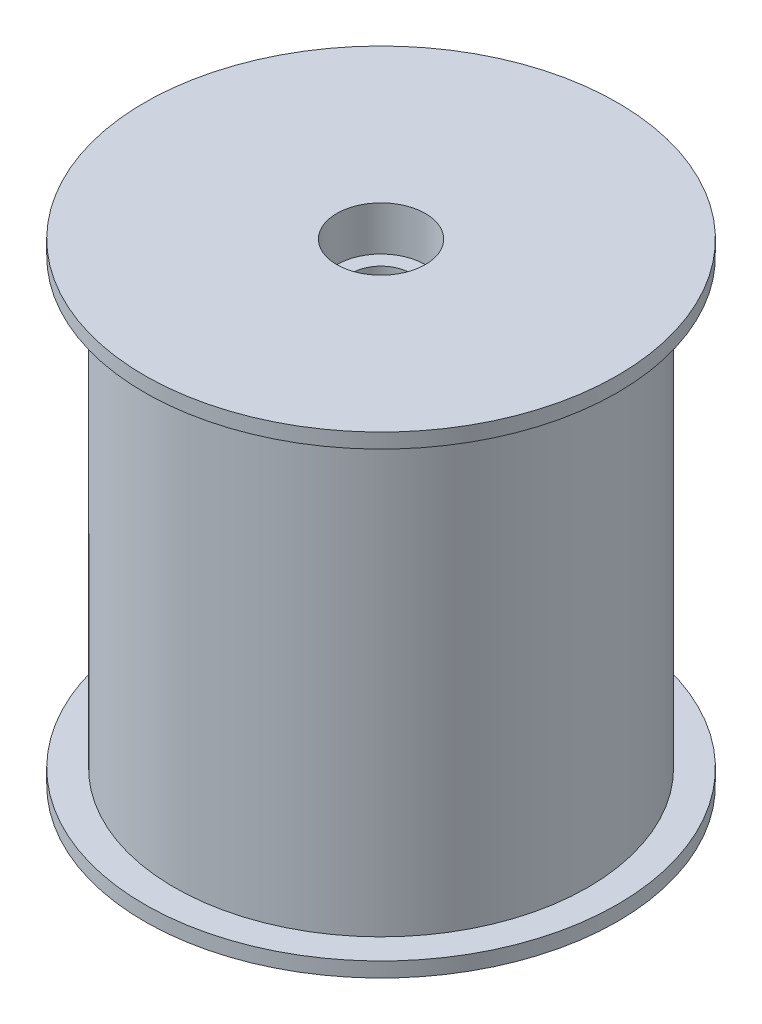
ISO-10303-21;
HEADER;
FILE_DESCRIPTION(('STEP AP214'),'2;1');
FILE_NAME('part.step','',(''),(''),'','','');
FILE_SCHEMA(('AUTOMOTIVE_DESIGN { 1 0 10303 214 1 1 1 1 }'));
ENDSEC;
DATA;
#1=APPLICATION_CONTEXT('core data for automotive mechanical design processes');
#2=APPLICATION_PROTOCOL_DEFINITION('international standard','automotive_design',2000,#1);
#3=PRODUCT_CONTEXT('',#1,'mechanical');
#4=PRODUCT('Part','Part','',(#3));
#5=PRODUCT_RELATED_PRODUCT_CATEGORY('part','',(#4));
#6=PRODUCT_DEFINITION_FORMATION('','',#4);
#7=PRODUCT_DEFINITION_CONTEXT('part definition',#1,'design');
#8=PRODUCT_DEFINITION('design','',#6,#7);
#9=PRODUCT_DEFINITION_SHAPE('','',#8);
#10=(LENGTH_UNIT() NAMED_UNIT(*) SI_UNIT(.MILLI.,.METRE.));
#11=(NAMED_UNIT(*) PLANE_ANGLE_UNIT() SI_UNIT($,.RADIAN.));
#12=(NAMED_UNIT(*) SI_UNIT($,.STERADIAN.) SOLID_ANGLE_UNIT());
#13=UNCERTAINTY_MEASURE_WITH_UNIT(LENGTH_MEASURE(1.E-05),#10,'distance_accuracy_value','');
#14=(GEOMETRIC_REPRESENTATION_CONTEXT(3) GLOBAL_UNCERTAINTY_ASSIGNED_CONTEXT((#13)) GLOBAL_UNIT_ASSIGNED_CONTEXT((#10,
#11,#12)) REPRESENTATION_CONTEXT('',''));
#15=CARTESIAN_POINT('',(0.,0.,0.));
#16=DIRECTION('',(0.,0.,1.));
#17=DIRECTION('',(1.,0.,0.));
#18=AXIS2_PLACEMENT_3D('',#15,#16,#17);
#19=CARTESIAN_POINT('',(0.,0.,0.));
#20=DIRECTION('',(0.,-1.,0.));
#21=DIRECTION('',(1.,0.,0.));
#22=AXIS2_PLACEMENT_3D('',#19,#20,#21);
#23=CYLINDRICAL_SURFACE('',#22,8.);
#24=CARTESIAN_POINT('',(0.,13.5078735821376,0.));
#25=DIRECTION('',(0.,-1.,0.));
#26=DIRECTION('',(1.,0.,0.));
#27=AXIS2_PLACEMENT_3D('',#24,#25,#26);
#28=CIRCLE('',#27,8.00000000000001);
#29=CARTESIAN_POINT('',(8.00000000000001,13.5078735821376,0.));
#30=VERTEX_POINT('',#29);
#31=EDGE_CURVE('E88',#30,#30,#28,.T.);
#32=ORIENTED_EDGE('',*,*,#31,.T.);
#33=EDGE_LOOP('',(#32));
#34=FACE_BOUND('',#33,.T.);
#35=CARTESIAN_POINT('',(0.,13.0078735821376,0.));
#36=DIRECTION('',(0.,-1.,0.));
#37=DIRECTION('',(1.,0.,0.));
#38=AXIS2_PLACEMENT_3D('',#35,#36,#37);
#39=CIRCLE('',#38,8.);
#40=CARTESIAN_POINT('',(8.,13.0078735821376,0.));
#41=VERTEX_POINT('',#40);
#42=EDGE_CURVE('E10',#41,#41,#39,.T.);
#43=ORIENTED_EDGE('',*,*,#42,.F.);
#44=EDGE_LOOP('',(#43));
#45=FACE_BOUND('',#44,.T.);
#46=ADVANCED_FACE('F37',(#34,#45),#23,.T.);
#47=CARTESIAN_POINT('',(8.,13.0078735821376,0.));
#48=DIRECTION('',(0.,-1.,0.));
#49=DIRECTION('',(1.,0.,0.));
#50=AXIS2_PLACEMENT_3D('',#47,#48,#49);
#51=PLANE('',#50);
#52=ORIENTED_EDGE('',*,*,#42,.T.);
#53=EDGE_LOOP('',(#52));
#54=FACE_BOUND('',#53,.T.);
#55=CARTESIAN_POINT('',(0.,13.0078735821376,0.));
#56=DIRECTION('',(0.,-1.,0.));
#57=DIRECTION('',(1.,0.,0.));
#58=AXIS2_PLACEMENT_3D('',#55,#56,#57);
#59=CIRCLE('',#58,7.);
#60=CARTESIAN_POINT('',(7.,13.0078735821376,0.));
#61=VERTEX_POINT('',#60);
#62=EDGE_CURVE('E44',#61,#61,#59,.T.);
#63=ORIENTED_EDGE('',*,*,#62,.F.);
#64=EDGE_LOOP('',(#63));
#65=FACE_BOUND('',#64,.T.);
#66=ADVANCED_FACE('F107',(#54,#65),#51,.T.);
#67=CARTESIAN_POINT('',(0.,0.,0.));
#68=DIRECTION('',(0.,-1.,0.));
#69=DIRECTION('',(1.,0.,0.));
#70=AXIS2_PLACEMENT_3D('',#67,#68,#69);
#71=CYLINDRICAL_SURFACE('',#70,7.);
#72=ORIENTED_EDGE('',*,*,#62,.T.);
#73=EDGE_LOOP('',(#72));
#74=FACE_BOUND('',#73,.T.);
#75=CARTESIAN_POINT('',(0.,-1.99212641786244,0.));
#76=DIRECTION('',(0.,-1.,0.));
#77=DIRECTION('',(1.,0.,0.));
#78=AXIS2_PLACEMENT_3D('',#75,#76,#77);
#79=CIRCLE('',#78,7.);
#80=CARTESIAN_POINT('',(7.,-1.99212641786244,0.));
#81=VERTEX_POINT('',#80);
#82=EDGE_CURVE('E49',#81,#81,#79,.T.);
#83=ORIENTED_EDGE('',*,*,#82,.F.);
#84=EDGE_LOOP('',(#83));
#85=FACE_BOUND('',#84,.T.);
#86=ADVANCED_FACE('F111',(#74,#85),#71,.T.);
#87=CARTESIAN_POINT('',(7.,-1.99212641786244,0.));
#88=DIRECTION('',(0.,1.,0.));
#89=DIRECTION('',(-1.,0.,0.));
#90=AXIS2_PLACEMENT_3D('',#87,#88,#89);
#91=PLANE('',#90);
#92=ORIENTED_EDGE('',*,*,#82,.T.);
#93=EDGE_LOOP('',(#92));
#94=FACE_BOUND('',#93,.T.);
#95=CARTESIAN_POINT('',(0.,-1.99212641786244,0.));
#96=DIRECTION('',(0.,-1.,0.));
#97=DIRECTION('',(1.,0.,0.));
#98=AXIS2_PLACEMENT_3D('',#95,#96,#97);
#99=CIRCLE('',#98,8.);
#100=CARTESIAN_POINT('',(8.,-1.99212641786244,0.));
#101=VERTEX_POINT('',#100);
#102=EDGE_CURVE('E54',#101,#101,#99,.T.);
#103=ORIENTED_EDGE('',*,*,#102,.F.);
#104=EDGE_LOOP('',(#103));
#105=FACE_BOUND('',#104,.T.);
#106=ADVANCED_FACE('F115',(#94,#105),#91,.T.);
#107=CARTESIAN_POINT('',(0.,0.,0.));
#108=DIRECTION('',(0.,-1.,0.));
#109=DIRECTION('',(1.,0.,0.));
#110=AXIS2_PLACEMENT_3D('',#107,#108,#109);
#111=CYLINDRICAL_SURFACE('',#110,8.);
#112=ORIENTED_EDGE('',*,*,#102,.T.);
#113=EDGE_LOOP('',(#112));
#114=FACE_BOUND('',#113,.T.);
#115=CARTESIAN_POINT('',(0.,-2.49212641786244,0.));
#116=DIRECTION('',(0.,-1.,0.));
#117=DIRECTION('',(1.,0.,0.));
#118=AXIS2_PLACEMENT_3D('',#115,#116,#117);
#119=CIRCLE('',#118,8.00000000000001);
#120=CARTESIAN_POINT('',(8.00000000000001,-2.49212641786244,0.));
#121=VERTEX_POINT('',#120);
#122=EDGE_CURVE('E60',#121,#121,#119,.T.);
#123=ORIENTED_EDGE('',*,*,#122,.F.);
#124=EDGE_LOOP('',(#123));
#125=FACE_BOUND('',#124,.T.);
#126=ADVANCED_FACE('F121',(#114,#125),#111,.T.);
#127=CARTESIAN_POINT('',(8.00000000000001,-2.49212641786244,0.));
#128=DIRECTION('',(0.,-1.,0.));
#129=DIRECTION('',(1.,0.,0.));
#130=AXIS2_PLACEMENT_3D('',#127,#128,#129);
#131=PLANE('',#130);
#132=ORIENTED_EDGE('',*,*,#122,.T.);
#133=EDGE_LOOP('',(#132));
#134=FACE_BOUND('',#133,.T.);
#135=CARTESIAN_POINT('',(0.,-2.49212641786244,0.));
#136=DIRECTION('',(0.,-1.,0.));
#137=DIRECTION('',(1.,0.,0.));
#138=AXIS2_PLACEMENT_3D('',#135,#136,#137);
#139=CIRCLE('',#138,3.75);
#140=CARTESIAN_POINT('',(3.75,-2.49212641786244,0.));
#141=VERTEX_POINT('',#140);
#142=EDGE_CURVE('E64',#141,#141,#139,.T.);
#143=ORIENTED_EDGE('',*,*,#142,.F.);
#144=EDGE_LOOP('',(#143));
#145=FACE_BOUND('',#144,.T.);
#146=ADVANCED_FACE('F125',(#134,#145),#131,.T.);
#147=CARTESIAN_POINT('',(0.,0.,0.));
#148=DIRECTION('',(0.,-1.,0.));
#149=DIRECTION('',(1.,0.,0.));
#150=AXIS2_PLACEMENT_3D('',#147,#148,#149);
#151=CYLINDRICAL_SURFACE('',#150,3.75);
#152=ORIENTED_EDGE('',*,*,#142,.T.);
#153=EDGE_LOOP('',(#152));
#154=FACE_BOUND('',#153,.T.);
#155=CARTESIAN_POINT('',(0.,10.5078735821376,0.));
#156=DIRECTION('',(0.,-1.,0.));
#157=DIRECTION('',(1.,0.,0.));
#158=AXIS2_PLACEMENT_3D('',#155,#156,#157);
#159=CIRCLE('',#158,3.75);
#160=CARTESIAN_POINT('',(3.75,10.5078735821376,0.));
#161=VERTEX_POINT('',#160);
#162=EDGE_CURVE('E68',#161,#161,#159,.T.);
#163=ORIENTED_EDGE('',*,*,#162,.F.);
#164=EDGE_LOOP('',(#163));
#165=FACE_BOUND('',#164,.T.);
#166=ADVANCED_FACE('F129',(#154,#165),#151,.F.);
#167=CARTESIAN_POINT('',(3.75,10.5078735821376,0.));
#168=DIRECTION('',(0.,-1.,0.));
#169=DIRECTION('',(1.,0.,0.));
#170=AXIS2_PLACEMENT_3D('',#167,#168,#169);
#171=PLANE('',#170);
#172=ORIENTED_EDGE('',*,*,#162,.T.);
#173=EDGE_LOOP('',(#172));
#174=FACE_BOUND('',#173,.T.);
#175=CARTESIAN_POINT('',(0.,10.5078735821376,0.));
#176=DIRECTION('',(0.,-1.,0.));
#177=DIRECTION('',(1.,0.,0.));
#178=AXIS2_PLACEMENT_3D('',#175,#176,#177);
#179=CIRCLE('',#178,1.);
#180=CARTESIAN_POINT('',(1.,10.5078735821376,0.));
#181=VERTEX_POINT('',#180);
#182=EDGE_CURVE('E72',#181,#181,#179,.T.);
#183=ORIENTED_EDGE('',*,*,#182,.F.);
#184=EDGE_LOOP('',(#183));
#185=FACE_BOUND('',#184,.T.);
#186=ADVANCED_FACE('F133',(#174,#185),#171,.T.);
#187=CARTESIAN_POINT('',(0.,0.,0.));
#188=DIRECTION('',(0.,-1.,0.));
#189=DIRECTION('',(1.,0.,0.));
#190=AXIS2_PLACEMENT_3D('',#187,#188,#189);
#191=CYLINDRICAL_SURFACE('',#190,1.);
#192=ORIENTED_EDGE('',*,*,#182,.T.);
#193=EDGE_LOOP('',(#192));
#194=FACE_BOUND('',#193,.T.);
#195=CARTESIAN_POINT('',(0.,12.0078735821376,0.));
#196=DIRECTION('',(0.,-1.,0.));
#197=DIRECTION('',(1.,0.,0.));
#198=AXIS2_PLACEMENT_3D('',#195,#196,#197);
#199=CIRCLE('',#198,1.);
#200=CARTESIAN_POINT('',(1.,12.0078735821376,0.));
#201=VERTEX_POINT('',#200);
#202=EDGE_CURVE('E76',#201,#201,#199,.T.);
#203=ORIENTED_EDGE('',*,*,#202,.F.);
#204=EDGE_LOOP('',(#203));
#205=FACE_BOUND('',#204,.T.);
#206=ADVANCED_FACE('F137',(#194,#205),#191,.F.);
#207=CARTESIAN_POINT('',(1.5,12.0078735821376,0.));
#208=DIRECTION('',(0.,1.,0.));
#209=DIRECTION('',(-1.,0.,0.));
#210=AXIS2_PLACEMENT_3D('',#207,#208,#209);
#211=PLANE('',#210);
#212=ORIENTED_EDGE('',*,*,#202,.T.);
#213=EDGE_LOOP('',(#212));
#214=FACE_BOUND('',#213,.T.);
#215=CARTESIAN_POINT('',(0.,12.0078735821376,0.));
#216=DIRECTION('',(0.,-1.,0.));
#217=DIRECTION('',(1.,0.,0.));
#218=AXIS2_PLACEMENT_3D('',#215,#216,#217);
#219=CIRCLE('',#218,1.5);
#220=CARTESIAN_POINT('',(1.5,12.0078735821376,0.));
#221=VERTEX_POINT('',#220);
#222=EDGE_CURVE('E80',#221,#221,#219,.T.);
#223=ORIENTED_EDGE('',*,*,#222,.F.);
#224=EDGE_LOOP('',(#223));
#225=FACE_BOUND('',#224,.T.);
#226=ADVANCED_FACE('F103',(#214,#225),#211,.T.);
#227=CARTESIAN_POINT('',(0.,0.,0.));
#228=DIRECTION('',(0.,-1.,0.));
#229=DIRECTION('',(1.,0.,0.));
#230=AXIS2_PLACEMENT_3D('',#227,#228,#229);
#231=CYLINDRICAL_SURFACE('',#230,1.5);
#232=ORIENTED_EDGE('',*,*,#222,.T.);
#233=EDGE_LOOP('',(#232));
#234=FACE_BOUND('',#233,.T.);
#235=CARTESIAN_POINT('',(0.,13.5078735821376,0.));
#236=DIRECTION('',(0.,-1.,0.));
#237=DIRECTION('',(1.,0.,0.));
#238=AXIS2_PLACEMENT_3D('',#235,#236,#237);
#239=CIRCLE('',#238,1.5);
#240=CARTESIAN_POINT('',(1.5,13.5078735821376,0.));
#241=VERTEX_POINT('',#240);
#242=EDGE_CURVE('E84',#241,#241,#239,.T.);
#243=ORIENTED_EDGE('',*,*,#242,.F.);
#244=EDGE_LOOP('',(#243));
#245=FACE_BOUND('',#244,.T.);
#246=ADVANCED_FACE('F97',(#234,#245),#231,.F.);
#247=CARTESIAN_POINT('',(1.5,13.5078735821376,0.));
#248=DIRECTION('',(0.,1.,0.));
#249=DIRECTION('',(-1.,0.,0.));
#250=AXIS2_PLACEMENT_3D('',#247,#248,#249);
#251=PLANE('',#250);
#252=ORIENTED_EDGE('',*,*,#242,.T.);
#253=EDGE_LOOP('',(#252));
#254=FACE_BOUND('',#253,.T.);
#255=ORIENTED_EDGE('',*,*,#31,.F.);
#256=EDGE_LOOP('',(#255));
#257=FACE_BOUND('',#256,.T.);
#258=ADVANCED_FACE('F95',(#254,#257),#251,.T.);
#259=CLOSED_SHELL('',(#46,#66,#86,#106,#126,#146,#166,#186,#206,#226,#246,#258));
#260=MANIFOLD_SOLID_BREP('B2',#259);
#261=ADVANCED_BREP_SHAPE_REPRESENTATION('',(#18,#260),#14);
#262=SHAPE_DEFINITION_REPRESENTATION(#9,#261);
ENDSEC;
END-ISO-10303-21;
